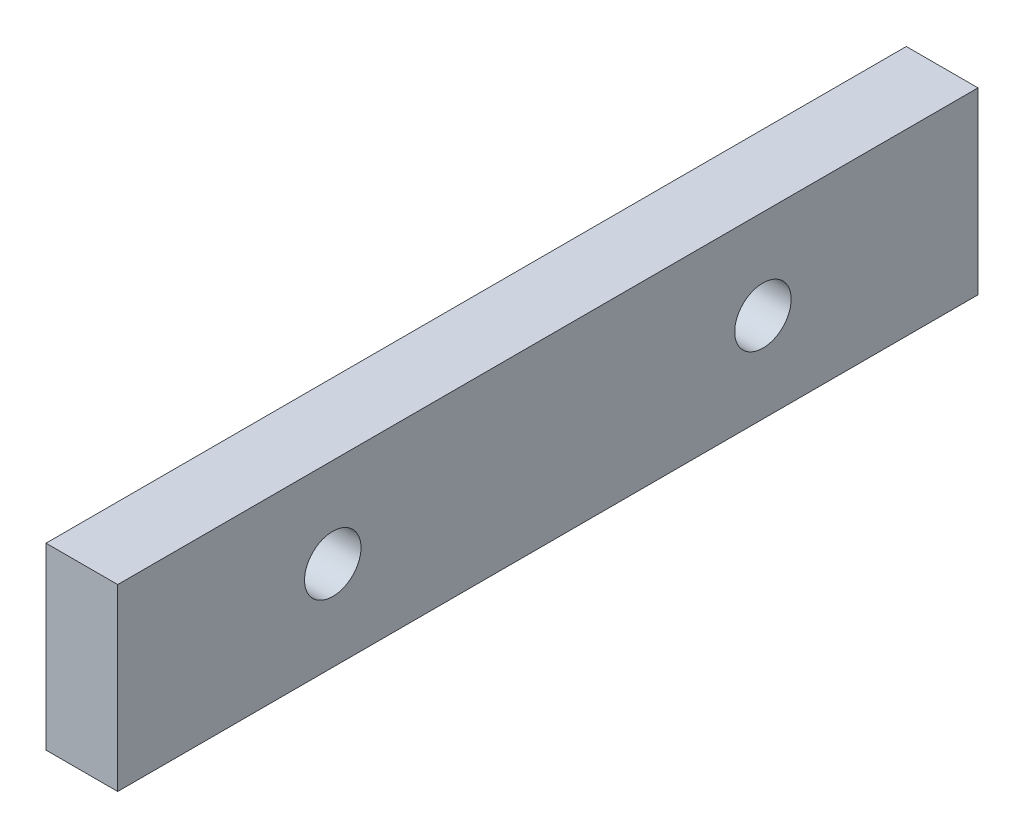
ISO-10303-21;
HEADER;
FILE_DESCRIPTION(('STEP AP214'),'2;1');
FILE_NAME('part.step','',(''),(''),'','','');
FILE_SCHEMA(('AUTOMOTIVE_DESIGN { 1 0 10303 214 1 1 1 1 }'));
ENDSEC;
DATA;
#1=APPLICATION_CONTEXT('core data for automotive mechanical design processes');
#2=APPLICATION_PROTOCOL_DEFINITION('international standard','automotive_design',2000,#1);
#3=PRODUCT_CONTEXT('',#1,'mechanical');
#4=PRODUCT('Part','Part','',(#3));
#5=PRODUCT_RELATED_PRODUCT_CATEGORY('part','',(#4));
#6=PRODUCT_DEFINITION_FORMATION('','',#4);
#7=PRODUCT_DEFINITION_CONTEXT('part definition',#1,'design');
#8=PRODUCT_DEFINITION('design','',#6,#7);
#9=PRODUCT_DEFINITION_SHAPE('','',#8);
#10=(LENGTH_UNIT() NAMED_UNIT(*) SI_UNIT(.MILLI.,.METRE.));
#11=(NAMED_UNIT(*) PLANE_ANGLE_UNIT() SI_UNIT($,.RADIAN.));
#12=(NAMED_UNIT(*) SI_UNIT($,.STERADIAN.) SOLID_ANGLE_UNIT());
#13=UNCERTAINTY_MEASURE_WITH_UNIT(LENGTH_MEASURE(1.E-05),#10,'distance_accuracy_value','');
#14=(GEOMETRIC_REPRESENTATION_CONTEXT(3) GLOBAL_UNCERTAINTY_ASSIGNED_CONTEXT((#13)) GLOBAL_UNIT_ASSIGNED_CONTEXT((#10,
#11,#12)) REPRESENTATION_CONTEXT('',''));
#15=CARTESIAN_POINT('',(0.,0.,0.));
#16=DIRECTION('',(0.,0.,1.));
#17=DIRECTION('',(1.,0.,0.));
#18=AXIS2_PLACEMENT_3D('',#15,#16,#17);
#19=CARTESIAN_POINT('',(3.175,7.9375,38.1));
#20=DIRECTION('',(-1.,0.,0.));
#21=DIRECTION('',(0.,-1.,0.));
#22=AXIS2_PLACEMENT_3D('',#19,#20,#21);
#23=PLANE('',#22);
#24=CARTESIAN_POINT('',(3.175,0.,19.05));
#25=DIRECTION('',(1.,0.,0.));
#26=DIRECTION('',(0.,0.,-1.));
#27=AXIS2_PLACEMENT_3D('',#24,#25,#26);
#28=CIRCLE('',#27,2.49999999999999);
#29=CARTESIAN_POINT('',(3.175,0.,16.55));
#30=VERTEX_POINT('',#29);
#31=EDGE_CURVE('E124',#30,#30,#28,.T.);
#32=ORIENTED_EDGE('',*,*,#31,.F.);
#33=EDGE_LOOP('',(#32));
#34=FACE_BOUND('',#33,.T.);
#35=DIRECTION('',(0.,1.,0.));
#36=VECTOR('',#35,1.);
#37=CARTESIAN_POINT('',(3.175,7.9375,-38.1));
#38=LINE('',#37,#36);
#39=CARTESIAN_POINT('',(3.175,-7.9375,-38.1));
#40=VERTEX_POINT('',#39);
#41=CARTESIAN_POINT('',(3.175,7.9375,-38.1));
#42=VERTEX_POINT('',#41);
#43=EDGE_CURVE('E101',#40,#42,#38,.T.);
#44=ORIENTED_EDGE('',*,*,#43,.T.);
#45=DIRECTION('',(0.,0.,-1.));
#46=VECTOR('',#45,1.);
#47=CARTESIAN_POINT('',(3.175,7.9375,38.1));
#48=LINE('',#47,#46);
#49=CARTESIAN_POINT('',(3.175,7.9375,38.1));
#50=VERTEX_POINT('',#49);
#51=EDGE_CURVE('E11',#50,#42,#48,.T.);
#52=ORIENTED_EDGE('',*,*,#51,.F.);
#53=DIRECTION('',(0.,1.,0.));
#54=VECTOR('',#53,1.);
#55=CARTESIAN_POINT('',(3.175,7.9375,38.1));
#56=LINE('',#55,#54);
#57=CARTESIAN_POINT('',(3.175,-7.9375,38.1));
#58=VERTEX_POINT('',#57);
#59=EDGE_CURVE('E89',#58,#50,#56,.T.);
#60=ORIENTED_EDGE('',*,*,#59,.F.);
#61=DIRECTION('',(0.,0.,-1.));
#62=VECTOR('',#61,1.);
#63=CARTESIAN_POINT('',(3.175,-7.9375,38.1));
#64=LINE('',#63,#62);
#65=EDGE_CURVE('E97',#58,#40,#64,.T.);
#66=ORIENTED_EDGE('',*,*,#65,.T.);
#67=EDGE_LOOP('',(#44,#52,#60,#66));
#68=FACE_BOUND('',#67,.T.);
#69=CARTESIAN_POINT('',(3.175,0.,-19.05));
#70=DIRECTION('',(1.,0.,0.));
#71=DIRECTION('',(0.,0.,-1.));
#72=AXIS2_PLACEMENT_3D('',#69,#70,#71);
#73=CIRCLE('',#72,2.49999999999999);
#74=CARTESIAN_POINT('',(3.175,0.,-21.55));
#75=VERTEX_POINT('',#74);
#76=EDGE_CURVE('E118',#75,#75,#73,.T.);
#77=ORIENTED_EDGE('',*,*,#76,.F.);
#78=EDGE_LOOP('',(#77));
#79=FACE_BOUND('',#78,.T.);
#80=ADVANCED_FACE('F38',(#34,#68,#79),#23,.F.);
#81=CARTESIAN_POINT('',(-3.175,7.9375,38.1));
#82=DIRECTION('',(0.,-1.,0.));
#83=DIRECTION('',(0.,0.,-1.));
#84=AXIS2_PLACEMENT_3D('',#81,#82,#83);
#85=PLANE('',#84);
#86=DIRECTION('',(-1.,0.,0.));
#87=VECTOR('',#86,1.);
#88=CARTESIAN_POINT('',(-3.175,7.9375,-38.1));
#89=LINE('',#88,#87);
#90=CARTESIAN_POINT('',(-3.175,7.9375,-38.1));
#91=VERTEX_POINT('',#90);
#92=EDGE_CURVE('E93',#42,#91,#89,.T.);
#93=ORIENTED_EDGE('',*,*,#92,.T.);
#94=DIRECTION('',(0.,0.,-1.));
#95=VECTOR('',#94,1.);
#96=CARTESIAN_POINT('',(-3.175,7.9375,38.1));
#97=LINE('',#96,#95);
#98=CARTESIAN_POINT('',(-3.175,7.9375,38.1));
#99=VERTEX_POINT('',#98);
#100=EDGE_CURVE('E46',#99,#91,#97,.T.);
#101=ORIENTED_EDGE('',*,*,#100,.F.);
#102=DIRECTION('',(-1.,0.,0.));
#103=VECTOR('',#102,1.);
#104=CARTESIAN_POINT('',(-3.175,7.9375,38.1));
#105=LINE('',#104,#103);
#106=EDGE_CURVE('E84',#50,#99,#105,.T.);
#107=ORIENTED_EDGE('',*,*,#106,.F.);
#108=ORIENTED_EDGE('',*,*,#51,.T.);
#109=EDGE_LOOP('',(#93,#101,#107,#108));
#110=FACE_BOUND('',#109,.T.);
#111=ADVANCED_FACE('F92',(#110),#85,.F.);
#112=CARTESIAN_POINT('',(-3.175,7.9375,38.1));
#113=DIRECTION('',(1.,0.,0.));
#114=DIRECTION('',(0.,1.,0.));
#115=AXIS2_PLACEMENT_3D('',#112,#113,#114);
#116=PLANE('',#115);
#117=CARTESIAN_POINT('',(-3.175,0.,19.05));
#118=DIRECTION('',(1.,0.,0.));
#119=DIRECTION('',(0.,1.,0.));
#120=AXIS2_PLACEMENT_3D('',#117,#118,#119);
#121=CIRCLE('',#120,2.49999999999999);
#122=CARTESIAN_POINT('',(-3.175,2.5,19.05));
#123=VERTEX_POINT('',#122);
#124=EDGE_CURVE('E121',#123,#123,#121,.T.);
#125=ORIENTED_EDGE('',*,*,#124,.T.);
#126=EDGE_LOOP('',(#125));
#127=FACE_BOUND('',#126,.T.);
#128=CARTESIAN_POINT('',(-3.175,0.,-19.05));
#129=DIRECTION('',(1.,0.,0.));
#130=DIRECTION('',(0.,1.,0.));
#131=AXIS2_PLACEMENT_3D('',#128,#129,#130);
#132=CIRCLE('',#131,2.49999999999999);
#133=CARTESIAN_POINT('',(-3.175,2.5,-19.05));
#134=VERTEX_POINT('',#133);
#135=EDGE_CURVE('E104',#134,#134,#132,.T.);
#136=ORIENTED_EDGE('',*,*,#135,.T.);
#137=EDGE_LOOP('',(#136));
#138=FACE_BOUND('',#137,.T.);
#139=DIRECTION('',(0.,-1.,0.));
#140=VECTOR('',#139,1.);
#141=CARTESIAN_POINT('',(-3.175,7.9375,-38.1));
#142=LINE('',#141,#140);
#143=CARTESIAN_POINT('',(-3.175,-7.9375,-38.1));
#144=VERTEX_POINT('',#143);
#145=EDGE_CURVE('E71',#91,#144,#142,.T.);
#146=ORIENTED_EDGE('',*,*,#145,.T.);
#147=DIRECTION('',(0.,0.,-1.));
#148=VECTOR('',#147,1.);
#149=CARTESIAN_POINT('',(-3.175,-7.9375,38.1));
#150=LINE('',#149,#148);
#151=CARTESIAN_POINT('',(-3.175,-7.9375,38.1));
#152=VERTEX_POINT('',#151);
#153=EDGE_CURVE('E94',#152,#144,#150,.T.);
#154=ORIENTED_EDGE('',*,*,#153,.F.);
#155=DIRECTION('',(0.,-1.,0.));
#156=VECTOR('',#155,1.);
#157=CARTESIAN_POINT('',(-3.175,7.9375,38.1));
#158=LINE('',#157,#156);
#159=EDGE_CURVE('E87',#99,#152,#158,.T.);
#160=ORIENTED_EDGE('',*,*,#159,.F.);
#161=ORIENTED_EDGE('',*,*,#100,.T.);
#162=EDGE_LOOP('',(#146,#154,#160,#161));
#163=FACE_BOUND('',#162,.T.);
#164=ADVANCED_FACE('F95',(#127,#138,#163),#116,.F.);
#165=CARTESIAN_POINT('',(-3.175,-7.9375,38.1));
#166=DIRECTION('',(0.,1.,0.));
#167=DIRECTION('',(0.,0.,1.));
#168=AXIS2_PLACEMENT_3D('',#165,#166,#167);
#169=PLANE('',#168);
#170=DIRECTION('',(1.,0.,0.));
#171=VECTOR('',#170,1.);
#172=CARTESIAN_POINT('',(-3.175,-7.9375,-38.1));
#173=LINE('',#172,#171);
#174=EDGE_CURVE('E77',#144,#40,#173,.T.);
#175=ORIENTED_EDGE('',*,*,#174,.T.);
#176=ORIENTED_EDGE('',*,*,#65,.F.);
#177=DIRECTION('',(1.,0.,0.));
#178=VECTOR('',#177,1.);
#179=CARTESIAN_POINT('',(-3.175,-7.9375,38.1));
#180=LINE('',#179,#178);
#181=EDGE_CURVE('E54',#152,#58,#180,.T.);
#182=ORIENTED_EDGE('',*,*,#181,.F.);
#183=ORIENTED_EDGE('',*,*,#153,.T.);
#184=EDGE_LOOP('',(#175,#176,#182,#183));
#185=FACE_BOUND('',#184,.T.);
#186=ADVANCED_FACE('F109',(#185),#169,.F.);
#187=CARTESIAN_POINT('',(3.175,-7.9375,38.1));
#188=DIRECTION('',(0.,0.,1.));
#189=DIRECTION('',(1.,0.,0.));
#190=AXIS2_PLACEMENT_3D('',#187,#188,#189);
#191=PLANE('',#190);
#192=ORIENTED_EDGE('',*,*,#59,.T.);
#193=ORIENTED_EDGE('',*,*,#106,.T.);
#194=ORIENTED_EDGE('',*,*,#159,.T.);
#195=ORIENTED_EDGE('',*,*,#181,.T.);
#196=EDGE_LOOP('',(#192,#193,#194,#195));
#197=FACE_BOUND('',#196,.T.);
#198=ADVANCED_FACE('F85',(#197),#191,.T.);
#199=CARTESIAN_POINT('',(3.175,-7.9375,-38.1));
#200=DIRECTION('',(0.,0.,1.));
#201=DIRECTION('',(1.,0.,0.));
#202=AXIS2_PLACEMENT_3D('',#199,#200,#201);
#203=PLANE('',#202);
#204=ORIENTED_EDGE('',*,*,#43,.F.);
#205=ORIENTED_EDGE('',*,*,#174,.F.);
#206=ORIENTED_EDGE('',*,*,#145,.F.);
#207=ORIENTED_EDGE('',*,*,#92,.F.);
#208=EDGE_LOOP('',(#204,#205,#206,#207));
#209=FACE_BOUND('',#208,.T.);
#210=ADVANCED_FACE('F112',(#209),#203,.F.);
#211=CARTESIAN_POINT('',(3.175,0.,-19.05));
#212=DIRECTION('',(1.,0.,0.));
#213=DIRECTION('',(0.,0.,-1.));
#214=AXIS2_PLACEMENT_3D('',#211,#212,#213);
#215=CYLINDRICAL_SURFACE('',#214,2.49999999999999);
#216=ORIENTED_EDGE('',*,*,#135,.F.);
#217=EDGE_LOOP('',(#216));
#218=FACE_BOUND('',#217,.T.);
#219=ORIENTED_EDGE('',*,*,#76,.T.);
#220=EDGE_LOOP('',(#219));
#221=FACE_BOUND('',#220,.T.);
#222=ADVANCED_FACE('F144',(#218,#221),#215,.F.);
#223=CARTESIAN_POINT('',(3.175,0.,19.05));
#224=DIRECTION('',(1.,0.,0.));
#225=DIRECTION('',(0.,0.,-1.));
#226=AXIS2_PLACEMENT_3D('',#223,#224,#225);
#227=CYLINDRICAL_SURFACE('',#226,2.49999999999999);
#228=ORIENTED_EDGE('',*,*,#124,.F.);
#229=EDGE_LOOP('',(#228));
#230=FACE_BOUND('',#229,.T.);
#231=ORIENTED_EDGE('',*,*,#31,.T.);
#232=EDGE_LOOP('',(#231));
#233=FACE_BOUND('',#232,.T.);
#234=ADVANCED_FACE('F128',(#230,#233),#227,.F.);
#235=CLOSED_SHELL('',(#80,#111,#164,#186,#198,#210,#222,#234));
#236=MANIFOLD_SOLID_BREP('B2',#235);
#237=ADVANCED_BREP_SHAPE_REPRESENTATION('',(#18,#236),#14);
#238=SHAPE_DEFINITION_REPRESENTATION(#9,#237);
ENDSEC;
END-ISO-10303-21;
